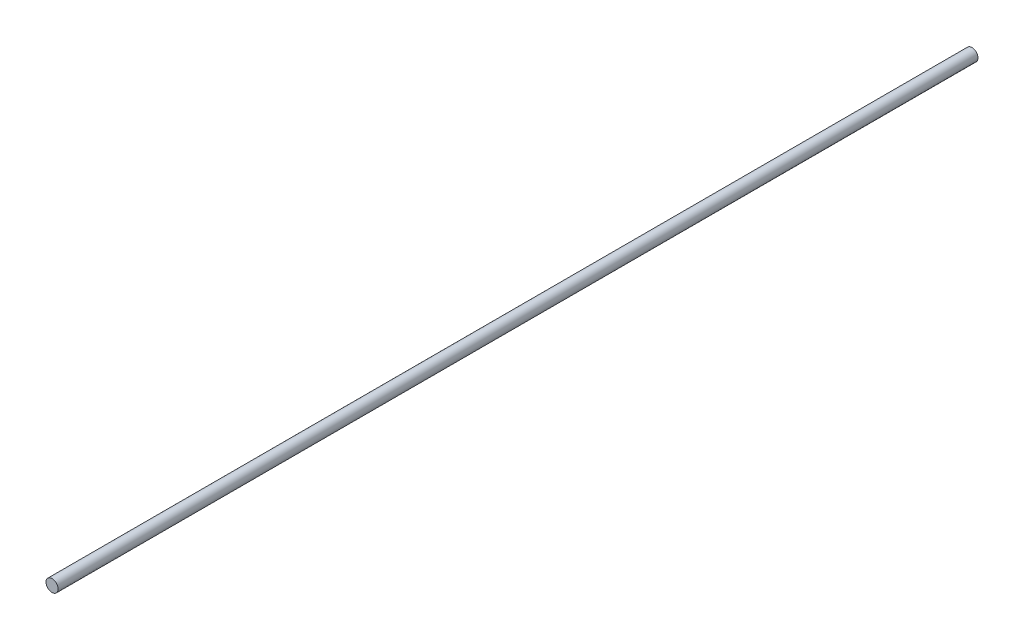
ISO-10303-21;
HEADER;
FILE_DESCRIPTION(('STEP AP214'),'2;1');
FILE_NAME('part.step','',(''),(''),'','','');
FILE_SCHEMA(('AUTOMOTIVE_DESIGN { 1 0 10303 214 1 1 1 1 }'));
ENDSEC;
DATA;
#1=APPLICATION_CONTEXT('core data for automotive mechanical design processes');
#2=APPLICATION_PROTOCOL_DEFINITION('international standard','automotive_design',2000,#1);
#3=PRODUCT_CONTEXT('',#1,'mechanical');
#4=PRODUCT('Part','Part','',(#3));
#5=PRODUCT_RELATED_PRODUCT_CATEGORY('part','',(#4));
#6=PRODUCT_DEFINITION_FORMATION('','',#4);
#7=PRODUCT_DEFINITION_CONTEXT('part definition',#1,'design');
#8=PRODUCT_DEFINITION('design','',#6,#7);
#9=PRODUCT_DEFINITION_SHAPE('','',#8);
#10=(LENGTH_UNIT() NAMED_UNIT(*) SI_UNIT(.MILLI.,.METRE.));
#11=(NAMED_UNIT(*) PLANE_ANGLE_UNIT() SI_UNIT($,.RADIAN.));
#12=(NAMED_UNIT(*) SI_UNIT($,.STERADIAN.) SOLID_ANGLE_UNIT());
#13=UNCERTAINTY_MEASURE_WITH_UNIT(LENGTH_MEASURE(1.E-05),#10,'distance_accuracy_value','');
#14=(GEOMETRIC_REPRESENTATION_CONTEXT(3) GLOBAL_UNCERTAINTY_ASSIGNED_CONTEXT((#13)) GLOBAL_UNIT_ASSIGNED_CONTEXT((#10,
#11,#12)) REPRESENTATION_CONTEXT('',''));
#15=CARTESIAN_POINT('',(0.,0.,0.));
#16=DIRECTION('',(0.,0.,1.));
#17=DIRECTION('',(1.,0.,0.));
#18=AXIS2_PLACEMENT_3D('',#15,#16,#17);
#19=CARTESIAN_POINT('',(0.,0.,482.6));
#20=DIRECTION('',(0.,0.,-1.));
#21=DIRECTION('',(-1.,0.,0.));
#22=AXIS2_PLACEMENT_3D('',#19,#20,#21);
#23=CYLINDRICAL_SURFACE('',#22,3.175);
#24=CARTESIAN_POINT('',(0.,0.,482.6));
#25=DIRECTION('',(0.,0.,1.));
#26=DIRECTION('',(1.,0.,0.));
#27=AXIS2_PLACEMENT_3D('',#24,#25,#26);
#28=CIRCLE('',#27,3.175);
#29=CARTESIAN_POINT('',(3.175,0.,482.6));
#30=VERTEX_POINT('',#29);
#31=EDGE_CURVE('E10',#30,#30,#28,.T.);
#32=ORIENTED_EDGE('',*,*,#31,.F.);
#33=EDGE_LOOP('',(#32));
#34=FACE_BOUND('',#33,.T.);
#35=CARTESIAN_POINT('',(0.,0.,0.));
#36=DIRECTION('',(0.,0.,1.));
#37=DIRECTION('',(1.,0.,0.));
#38=AXIS2_PLACEMENT_3D('',#35,#36,#37);
#39=CIRCLE('',#38,3.175);
#40=CARTESIAN_POINT('',(3.175,0.,0.));
#41=VERTEX_POINT('',#40);
#42=EDGE_CURVE('E34',#41,#41,#39,.T.);
#43=ORIENTED_EDGE('',*,*,#42,.T.);
#44=EDGE_LOOP('',(#43));
#45=FACE_BOUND('',#44,.T.);
#46=ADVANCED_FACE('F31',(#34,#45),#23,.T.);
#47=CARTESIAN_POINT('',(0.,0.,482.6));
#48=DIRECTION('',(0.,0.,1.));
#49=DIRECTION('',(1.,0.,0.));
#50=AXIS2_PLACEMENT_3D('',#47,#48,#49);
#51=PLANE('',#50);
#52=ORIENTED_EDGE('',*,*,#31,.T.);
#53=EDGE_LOOP('',(#52));
#54=FACE_BOUND('',#53,.T.);
#55=ADVANCED_FACE('F46',(#54),#51,.T.);
#56=CARTESIAN_POINT('',(0.,0.,0.));
#57=DIRECTION('',(0.,0.,1.));
#58=DIRECTION('',(1.,0.,0.));
#59=AXIS2_PLACEMENT_3D('',#56,#57,#58);
#60=PLANE('',#59);
#61=ORIENTED_EDGE('',*,*,#42,.F.);
#62=EDGE_LOOP('',(#61));
#63=FACE_BOUND('',#62,.T.);
#64=ADVANCED_FACE('F44',(#63),#60,.F.);
#65=CLOSED_SHELL('',(#46,#55,#64));
#66=MANIFOLD_SOLID_BREP('B2',#65);
#67=ADVANCED_BREP_SHAPE_REPRESENTATION('',(#18,#66),#14);
#68=SHAPE_DEFINITION_REPRESENTATION(#9,#67);
ENDSEC;
END-ISO-10303-21;
